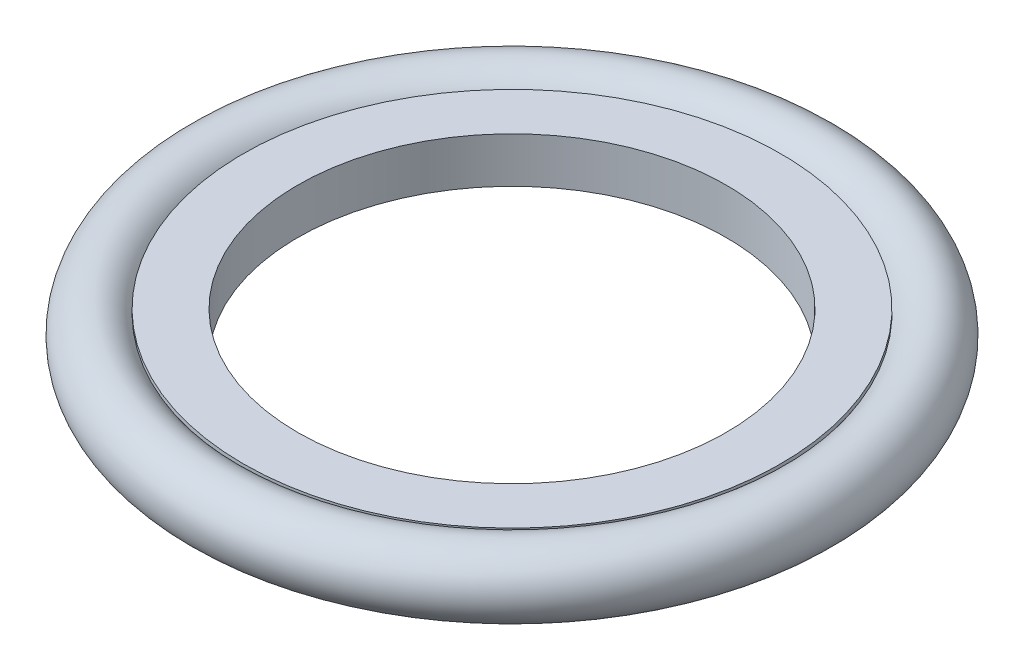
ISO-10303-21;
HEADER;
FILE_DESCRIPTION(('STEP AP214'),'2;1');
FILE_NAME('part.step','',(''),(''),'','','');
FILE_SCHEMA(('AUTOMOTIVE_DESIGN { 1 0 10303 214 1 1 1 1 }'));
ENDSEC;
DATA;
#1=APPLICATION_CONTEXT('core data for automotive mechanical design processes');
#2=APPLICATION_PROTOCOL_DEFINITION('international standard','automotive_design',2000,#1);
#3=PRODUCT_CONTEXT('',#1,'mechanical');
#4=PRODUCT('Part','Part','',(#3));
#5=PRODUCT_RELATED_PRODUCT_CATEGORY('part','',(#4));
#6=PRODUCT_DEFINITION_FORMATION('','',#4);
#7=PRODUCT_DEFINITION_CONTEXT('part definition',#1,'design');
#8=PRODUCT_DEFINITION('design','',#6,#7);
#9=PRODUCT_DEFINITION_SHAPE('','',#8);
#10=(LENGTH_UNIT() NAMED_UNIT(*) SI_UNIT(.MILLI.,.METRE.));
#11=(NAMED_UNIT(*) PLANE_ANGLE_UNIT() SI_UNIT($,.RADIAN.));
#12=(NAMED_UNIT(*) SI_UNIT($,.STERADIAN.) SOLID_ANGLE_UNIT());
#13=UNCERTAINTY_MEASURE_WITH_UNIT(LENGTH_MEASURE(1.E-05),#10,'distance_accuracy_value','');
#14=(GEOMETRIC_REPRESENTATION_CONTEXT(3) GLOBAL_UNCERTAINTY_ASSIGNED_CONTEXT((#13)) GLOBAL_UNIT_ASSIGNED_CONTEXT((#10,
#11,#12)) REPRESENTATION_CONTEXT('',''));
#15=CARTESIAN_POINT('',(0.,0.,0.));
#16=DIRECTION('',(0.,0.,1.));
#17=DIRECTION('',(1.,0.,0.));
#18=AXIS2_PLACEMENT_3D('',#15,#16,#17);
#19=CARTESIAN_POINT('',(0.,17.526,-207.079055579163));
#20=DIRECTION('',(0.,-1.,0.));
#21=DIRECTION('',(0.,0.,-1.));
#22=AXIS2_PLACEMENT_3D('',#19,#20,#21);
#23=PLANE('',#22);
#24=CARTESIAN_POINT('',(0.,17.526,0.));
#25=DIRECTION('',(0.,1.,0.));
#26=DIRECTION('',(0.,0.,1.));
#27=AXIS2_PLACEMENT_3D('',#24,#25,#26);
#28=CIRCLE('',#27,165.159198992487);
#29=CARTESIAN_POINT('',(0.,17.526,165.159198992487));
#30=VERTEX_POINT('',#29);
#31=EDGE_CURVE('E11',#30,#30,#28,.T.);
#32=ORIENTED_EDGE('',*,*,#31,.F.);
#33=EDGE_LOOP('',(#32));
#34=FACE_BOUND('',#33,.T.);
#35=CARTESIAN_POINT('',(0.,17.526,0.));
#36=DIRECTION('',(0.,1.,0.));
#37=DIRECTION('',(0.,0.,1.));
#38=AXIS2_PLACEMENT_3D('',#35,#36,#37);
#39=CIRCLE('',#38,207.079055579163);
#40=CARTESIAN_POINT('',(0.,17.526,207.079055579163));
#41=VERTEX_POINT('',#40);
#42=EDGE_CURVE('E70',#41,#41,#39,.T.);
#43=ORIENTED_EDGE('',*,*,#42,.T.);
#44=EDGE_LOOP('',(#43));
#45=FACE_BOUND('',#44,.T.);
#46=ADVANCED_FACE('F42',(#34,#45),#23,.F.);
#47=CARTESIAN_POINT('',(0.,0.,0.));
#48=DIRECTION('',(0.,1.,0.));
#49=DIRECTION('',(0.,0.,1.));
#50=AXIS2_PLACEMENT_3D('',#47,#48,#49);
#51=CYLINDRICAL_SURFACE('',#50,165.159198992487);
#52=CARTESIAN_POINT('',(0.,-17.526,0.));
#53=DIRECTION('',(0.,1.,0.));
#54=DIRECTION('',(0.,0.,1.));
#55=AXIS2_PLACEMENT_3D('',#52,#53,#54);
#56=CIRCLE('',#55,165.159198992487);
#57=CARTESIAN_POINT('',(0.,-17.526,165.159198992487));
#58=VERTEX_POINT('',#57);
#59=EDGE_CURVE('E48',#58,#58,#56,.T.);
#60=ORIENTED_EDGE('',*,*,#59,.F.);
#61=EDGE_LOOP('',(#60));
#62=FACE_BOUND('',#61,.T.);
#63=ORIENTED_EDGE('',*,*,#31,.T.);
#64=EDGE_LOOP('',(#63));
#65=FACE_BOUND('',#64,.T.);
#66=ADVANCED_FACE('F107',(#62,#65),#51,.F.);
#67=CARTESIAN_POINT('',(0.,-17.526,-207.079055579163));
#68=DIRECTION('',(0.,1.,0.));
#69=DIRECTION('',(0.,0.,1.));
#70=AXIS2_PLACEMENT_3D('',#67,#68,#69);
#71=PLANE('',#70);
#72=CARTESIAN_POINT('',(0.,-17.526,0.));
#73=DIRECTION('',(0.,1.,0.));
#74=DIRECTION('',(0.,0.,1.));
#75=AXIS2_PLACEMENT_3D('',#72,#73,#74);
#76=CIRCLE('',#75,207.079055579163);
#77=CARTESIAN_POINT('',(0.,-17.526,207.079055579163));
#78=VERTEX_POINT('',#77);
#79=EDGE_CURVE('E52',#78,#78,#76,.T.);
#80=ORIENTED_EDGE('',*,*,#79,.F.);
#81=EDGE_LOOP('',(#80));
#82=FACE_BOUND('',#81,.T.);
#83=ORIENTED_EDGE('',*,*,#59,.T.);
#84=EDGE_LOOP('',(#83));
#85=FACE_BOUND('',#84,.T.);
#86=ADVANCED_FACE('F102',(#82,#85),#71,.F.);
#87=CARTESIAN_POINT('',(0.,0.,0.));
#88=DIRECTION('',(0.,1.,0.));
#89=DIRECTION('',(0.,0.,1.));
#90=AXIS2_PLACEMENT_3D('',#87,#88,#89);
#91=CYLINDRICAL_SURFACE('',#90,207.079055579163);
#92=CARTESIAN_POINT('',(0.,-14.351,0.));
#93=DIRECTION('',(0.,1.,0.));
#94=DIRECTION('',(0.,0.,1.));
#95=AXIS2_PLACEMENT_3D('',#92,#93,#94);
#96=CIRCLE('',#95,207.079055579163);
#97=CARTESIAN_POINT('',(0.,-14.351,207.079055579163));
#98=VERTEX_POINT('',#97);
#99=EDGE_CURVE('E56',#98,#98,#96,.T.);
#100=ORIENTED_EDGE('',*,*,#99,.F.);
#101=EDGE_LOOP('',(#100));
#102=FACE_BOUND('',#101,.T.);
#103=ORIENTED_EDGE('',*,*,#79,.T.);
#104=EDGE_LOOP('',(#103));
#105=FACE_BOUND('',#104,.T.);
#106=ADVANCED_FACE('F96',(#102,#105),#91,.T.);
#107=CARTESIAN_POINT('',(0.,-14.351,-207.079055579163));
#108=DIRECTION('',(0.,-1.,0.));
#109=DIRECTION('',(0.,0.,-1.));
#110=AXIS2_PLACEMENT_3D('',#107,#108,#109);
#111=PLANE('',#110);
#112=CARTESIAN_POINT('',(0.,-14.351,0.));
#113=DIRECTION('',(0.,1.,0.));
#114=DIRECTION('',(0.,0.,1.));
#115=AXIS2_PLACEMENT_3D('',#112,#113,#114);
#116=CIRCLE('',#115,168.334198992487);
#117=CARTESIAN_POINT('',(0.,-14.351,168.334198992487));
#118=VERTEX_POINT('',#117);
#119=EDGE_CURVE('E61',#118,#118,#116,.T.);
#120=ORIENTED_EDGE('',*,*,#119,.F.);
#121=EDGE_LOOP('',(#120));
#122=FACE_BOUND('',#121,.T.);
#123=ORIENTED_EDGE('',*,*,#99,.T.);
#124=EDGE_LOOP('',(#123));
#125=FACE_BOUND('',#124,.T.);
#126=ADVANCED_FACE('F90',(#122,#125),#111,.F.);
#127=CARTESIAN_POINT('',(0.,0.,0.));
#128=DIRECTION('',(0.,1.,0.));
#129=DIRECTION('',(0.,0.,1.));
#130=AXIS2_PLACEMENT_3D('',#127,#128,#129);
#131=CYLINDRICAL_SURFACE('',#130,168.334198992487);
#132=CARTESIAN_POINT('',(0.,14.351,0.));
#133=DIRECTION('',(0.,1.,0.));
#134=DIRECTION('',(0.,0.,1.));
#135=AXIS2_PLACEMENT_3D('',#132,#133,#134);
#136=CIRCLE('',#135,168.334198992487);
#137=CARTESIAN_POINT('',(0.,14.351,168.334198992487));
#138=VERTEX_POINT('',#137);
#139=EDGE_CURVE('E64',#138,#138,#136,.T.);
#140=ORIENTED_EDGE('',*,*,#139,.F.);
#141=EDGE_LOOP('',(#140));
#142=FACE_BOUND('',#141,.T.);
#143=ORIENTED_EDGE('',*,*,#119,.T.);
#144=EDGE_LOOP('',(#143));
#145=FACE_BOUND('',#144,.T.);
#146=ADVANCED_FACE('F84',(#142,#145),#131,.T.);
#147=CARTESIAN_POINT('',(0.,14.351,-207.079055579163));
#148=DIRECTION('',(0.,1.,0.));
#149=DIRECTION('',(0.,0.,1.));
#150=AXIS2_PLACEMENT_3D('',#147,#148,#149);
#151=PLANE('',#150);
#152=CARTESIAN_POINT('',(0.,14.351,0.));
#153=DIRECTION('',(0.,1.,0.));
#154=DIRECTION('',(0.,0.,1.));
#155=AXIS2_PLACEMENT_3D('',#152,#153,#154);
#156=CIRCLE('',#155,207.079055579163);
#157=CARTESIAN_POINT('',(0.,14.351,207.079055579163));
#158=VERTEX_POINT('',#157);
#159=EDGE_CURVE('E67',#158,#158,#156,.T.);
#160=ORIENTED_EDGE('',*,*,#159,.F.);
#161=EDGE_LOOP('',(#160));
#162=FACE_BOUND('',#161,.T.);
#163=ORIENTED_EDGE('',*,*,#139,.T.);
#164=EDGE_LOOP('',(#163));
#165=FACE_BOUND('',#164,.T.);
#166=ADVANCED_FACE('F78',(#162,#165),#151,.F.);
#167=CARTESIAN_POINT('',(0.,0.,0.));
#168=DIRECTION('',(0.,1.,0.));
#169=DIRECTION('',(0.,0.,1.));
#170=AXIS2_PLACEMENT_3D('',#167,#168,#169);
#171=CYLINDRICAL_SURFACE('',#170,207.079055579163);
#172=ORIENTED_EDGE('',*,*,#42,.F.);
#173=EDGE_LOOP('',(#172));
#174=FACE_BOUND('',#173,.T.);
#175=ORIENTED_EDGE('',*,*,#159,.T.);
#176=EDGE_LOOP('',(#175));
#177=FACE_BOUND('',#176,.T.);
#178=ADVANCED_FACE('F75',(#174,#177),#171,.T.);
#179=CLOSED_SHELL('',(#46,#66,#86,#106,#126,#146,#166,#178));
#180=MANIFOLD_SOLID_BREP('B2',#179);
#181=CARTESIAN_POINT('',(0.,0.,0.));
#182=DIRECTION('',(0.,1.,0.));
#183=DIRECTION('',(0.,0.,1.));
#184=AXIS2_PLACEMENT_3D('',#181,#182,#183);
#185=TOROIDAL_SURFACE('',#184,228.344866071429,25.6551339285714);
#186=CARTESIAN_POINT('',(0.,0.,254.));
#187=VERTEX_POINT('',#186);
#188=VERTEX_LOOP('',#187);
#189=FACE_BOUND('',#188,.T.);
#190=ADVANCED_FACE('F163',(#189),#185,.T.);
#191=CLOSED_SHELL('',(#190));
#192=MANIFOLD_SOLID_BREP('B6',#191);
#193=ADVANCED_BREP_SHAPE_REPRESENTATION('',(#18,#180,#192),#14);
#194=SHAPE_DEFINITION_REPRESENTATION(#9,#193);
ENDSEC;
END-ISO-10303-21;
